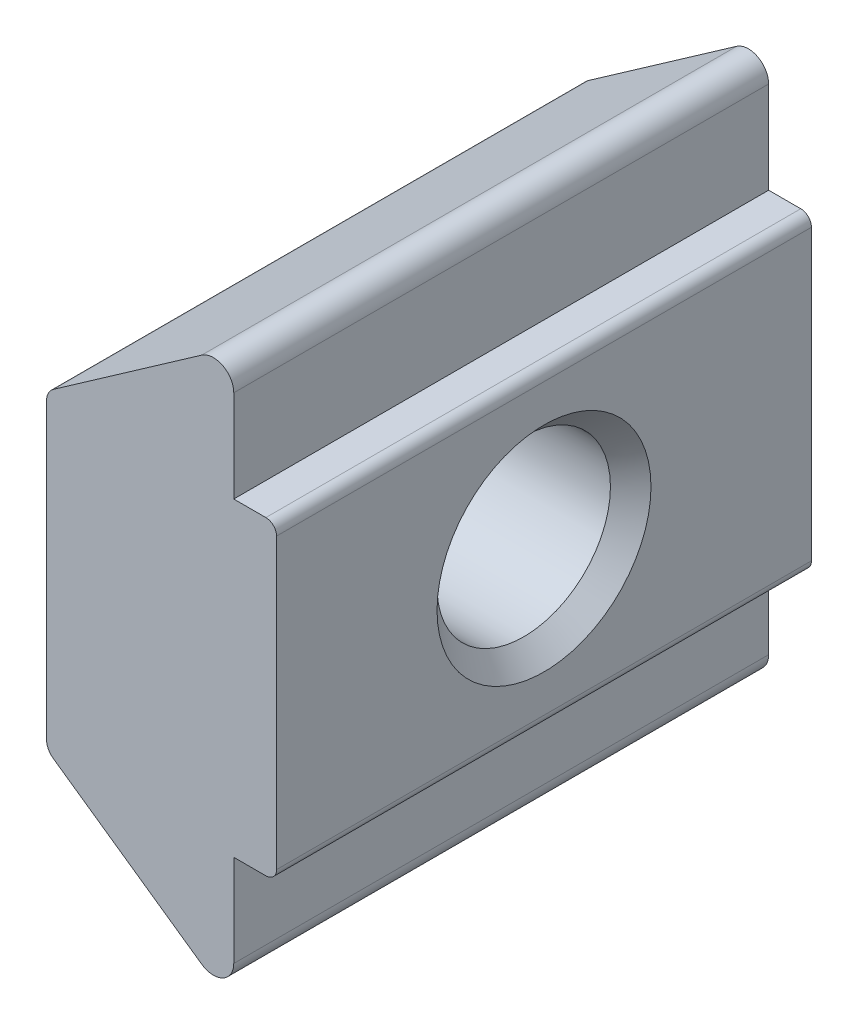
ISO-10303-21;
HEADER;
FILE_DESCRIPTION(('STEP AP214'),'2;1');
FILE_NAME('part.step','',(''),(''),'','','');
FILE_SCHEMA(('AUTOMOTIVE_DESIGN { 1 0 10303 214 1 1 1 1 }'));
ENDSEC;
DATA;
#1=APPLICATION_CONTEXT('core data for automotive mechanical design processes');
#2=APPLICATION_PROTOCOL_DEFINITION('international standard','automotive_design',2000,#1);
#3=PRODUCT_CONTEXT('',#1,'mechanical');
#4=PRODUCT('Part','Part','',(#3));
#5=PRODUCT_RELATED_PRODUCT_CATEGORY('part','',(#4));
#6=PRODUCT_DEFINITION_FORMATION('','',#4);
#7=PRODUCT_DEFINITION_CONTEXT('part definition',#1,'design');
#8=PRODUCT_DEFINITION('design','',#6,#7);
#9=PRODUCT_DEFINITION_SHAPE('','',#8);
#10=(LENGTH_UNIT() NAMED_UNIT(*) SI_UNIT(.MILLI.,.METRE.));
#11=(NAMED_UNIT(*) PLANE_ANGLE_UNIT() SI_UNIT($,.RADIAN.));
#12=(NAMED_UNIT(*) SI_UNIT($,.STERADIAN.) SOLID_ANGLE_UNIT());
#13=UNCERTAINTY_MEASURE_WITH_UNIT(LENGTH_MEASURE(1.E-05),#10,'distance_accuracy_value','');
#14=(GEOMETRIC_REPRESENTATION_CONTEXT(3) GLOBAL_UNCERTAINTY_ASSIGNED_CONTEXT((#13)) GLOBAL_UNIT_ASSIGNED_CONTEXT((#10,
#11,#12)) REPRESENTATION_CONTEXT('',''));
#15=CARTESIAN_POINT('',(0.,0.,0.));
#16=DIRECTION('',(0.,0.,1.));
#17=DIRECTION('',(1.,0.,0.));
#18=AXIS2_PLACEMENT_3D('',#15,#16,#17);
#19=CARTESIAN_POINT('',(-4.,2.74380333152799,5.));
#20=DIRECTION('',(0.,0.,-1.));
#21=DIRECTION('',(-1.,0.,0.));
#22=AXIS2_PLACEMENT_3D('',#19,#20,#21);
#23=CYLINDRICAL_SURFACE('',#22,0.3);
#24=CARTESIAN_POINT('',(-4.,2.74380333152799,-5.));
#25=DIRECTION('',(0.,0.,1.));
#26=DIRECTION('',(1.,0.,0.));
#27=AXIS2_PLACEMENT_3D('',#24,#25,#26);
#28=CIRCLE('',#27,0.3);
#29=CARTESIAN_POINT('',(-4.172038703309,2.98957290768371,-5.));
#30=VERTEX_POINT('',#29);
#31=CARTESIAN_POINT('',(-4.3,2.74380333152799,-5.));
#32=VERTEX_POINT('',#31);
#33=EDGE_CURVE('E11',#30,#32,#28,.T.);
#34=ORIENTED_EDGE('',*,*,#33,.T.);
#35=DIRECTION('',(0.,0.,-1.));
#36=VECTOR('',#35,1.);
#37=CARTESIAN_POINT('',(-4.3,2.74380333152799,5.));
#38=LINE('',#37,#36);
#39=CARTESIAN_POINT('',(-4.3,2.74380333152799,5.));
#40=VERTEX_POINT('',#39);
#41=EDGE_CURVE('E41',#40,#32,#38,.T.);
#42=ORIENTED_EDGE('',*,*,#41,.F.);
#43=CARTESIAN_POINT('',(-4.,2.74380333152799,5.));
#44=DIRECTION('',(0.,0.,1.));
#45=DIRECTION('',(1.,0.,0.));
#46=AXIS2_PLACEMENT_3D('',#43,#44,#45);
#47=CIRCLE('',#46,0.3);
#48=CARTESIAN_POINT('',(-4.172038703309,2.98957290768371,5.));
#49=VERTEX_POINT('',#48);
#50=EDGE_CURVE('E91',#49,#40,#47,.T.);
#51=ORIENTED_EDGE('',*,*,#50,.F.);
#52=DIRECTION('',(0.,0.,-1.));
#53=VECTOR('',#52,1.);
#54=CARTESIAN_POINT('',(-4.172038703309,2.98957290768371,5.));
#55=LINE('',#54,#53);
#56=EDGE_CURVE('E27',#49,#30,#55,.T.);
#57=ORIENTED_EDGE('',*,*,#56,.T.);
#58=EDGE_LOOP('',(#34,#42,#51,#57));
#59=FACE_BOUND('',#58,.T.);
#60=ADVANCED_FACE('F16',(#59),#23,.T.);
#61=CARTESIAN_POINT('',(-4.3,2.74380333152799,5.));
#62=DIRECTION('',(1.,0.,0.));
#63=DIRECTION('',(0.,1.,0.));
#64=AXIS2_PLACEMENT_3D('',#61,#62,#63);
#65=PLANE('',#64);
#66=CARTESIAN_POINT('',(-4.3,0.,0.));
#67=DIRECTION('',(1.,0.,0.));
#68=DIRECTION('',(0.,0.,-1.));
#69=AXIS2_PLACEMENT_3D('',#66,#67,#68);
#70=CIRCLE('',#69,2.);
#71=CARTESIAN_POINT('',(-4.3,0.,-2.));
#72=VERTEX_POINT('',#71);
#73=EDGE_CURVE('E293',#72,#72,#70,.T.);
#74=ORIENTED_EDGE('',*,*,#73,.T.);
#75=EDGE_LOOP('',(#74));
#76=FACE_BOUND('',#75,.T.);
#77=DIRECTION('',(0.,-1.,0.));
#78=VECTOR('',#77,1.);
#79=CARTESIAN_POINT('',(-4.3,2.74380333152799,-5.));
#80=LINE('',#79,#78);
#81=CARTESIAN_POINT('',(-4.3,-2.74380333152799,-5.));
#82=VERTEX_POINT('',#81);
#83=EDGE_CURVE('E188',#32,#82,#80,.T.);
#84=ORIENTED_EDGE('',*,*,#83,.T.);
#85=DIRECTION('',(0.,0.,-1.));
#86=VECTOR('',#85,1.);
#87=CARTESIAN_POINT('',(-4.3,-2.74380333152799,5.));
#88=LINE('',#87,#86);
#89=CARTESIAN_POINT('',(-4.3,-2.74380333152799,5.));
#90=VERTEX_POINT('',#89);
#91=EDGE_CURVE('E185',#90,#82,#88,.T.);
#92=ORIENTED_EDGE('',*,*,#91,.F.);
#93=DIRECTION('',(0.,-1.,0.));
#94=VECTOR('',#93,1.);
#95=CARTESIAN_POINT('',(-4.3,2.74380333152799,5.));
#96=LINE('',#95,#94);
#97=EDGE_CURVE('E176',#40,#90,#96,.T.);
#98=ORIENTED_EDGE('',*,*,#97,.F.);
#99=ORIENTED_EDGE('',*,*,#41,.T.);
#100=EDGE_LOOP('',(#84,#92,#98,#99));
#101=FACE_BOUND('',#100,.T.);
#102=ADVANCED_FACE('F186',(#76,#101),#65,.F.);
#103=CARTESIAN_POINT('',(-4.,-2.74380333152799,5.));
#104=DIRECTION('',(0.,0.,-1.));
#105=DIRECTION('',(-1.,0.,0.));
#106=AXIS2_PLACEMENT_3D('',#103,#104,#105);
#107=CYLINDRICAL_SURFACE('',#106,0.3);
#108=CARTESIAN_POINT('',(-4.,-2.74380333152799,-5.));
#109=DIRECTION('',(0.,0.,1.));
#110=DIRECTION('',(1.,0.,0.));
#111=AXIS2_PLACEMENT_3D('',#108,#109,#110);
#112=CIRCLE('',#111,0.3);
#113=CARTESIAN_POINT('',(-4.172038703309,-2.98957290768371,-5.));
#114=VERTEX_POINT('',#113);
#115=EDGE_CURVE('E193',#82,#114,#112,.T.);
#116=ORIENTED_EDGE('',*,*,#115,.T.);
#117=DIRECTION('',(0.,0.,-1.));
#118=VECTOR('',#117,1.);
#119=CARTESIAN_POINT('',(-4.172038703309,-2.98957290768371,5.));
#120=LINE('',#119,#118);
#121=CARTESIAN_POINT('',(-4.172038703309,-2.98957290768371,5.));
#122=VERTEX_POINT('',#121);
#123=EDGE_CURVE('E197',#122,#114,#120,.T.);
#124=ORIENTED_EDGE('',*,*,#123,.F.);
#125=CARTESIAN_POINT('',(-4.,-2.74380333152799,5.));
#126=DIRECTION('',(0.,0.,1.));
#127=DIRECTION('',(1.,0.,0.));
#128=AXIS2_PLACEMENT_3D('',#125,#126,#127);
#129=CIRCLE('',#128,0.3);
#130=EDGE_CURVE('E180',#90,#122,#129,.T.);
#131=ORIENTED_EDGE('',*,*,#130,.F.);
#132=ORIENTED_EDGE('',*,*,#91,.T.);
#133=EDGE_LOOP('',(#116,#124,#131,#132));
#134=FACE_BOUND('',#133,.T.);
#135=ADVANCED_FACE('F196',(#134),#107,.T.);
#136=CARTESIAN_POINT('',(-4.172038703309,-2.98957290768371,5.));
#137=DIRECTION('',(0.573462344363326,0.819231920519042,0.));
#138=DIRECTION('',(0.,0.,-1.));
#139=AXIS2_PLACEMENT_3D('',#136,#137,#138);
#140=PLANE('',#139);
#141=DIRECTION('',(0.819231920519042,-0.573462344363326,0.));
#142=VECTOR('',#141,1.);
#143=CARTESIAN_POINT('',(-4.172038703309,-2.98957290768371,-5.));
#144=LINE('',#143,#142);
#145=CARTESIAN_POINT('',(-1.39821476510065,-4.93124966442954,-5.));
#146=VERTEX_POINT('',#145);
#147=EDGE_CURVE('E194',#114,#146,#144,.T.);
#148=ORIENTED_EDGE('',*,*,#147,.T.);
#149=DIRECTION('',(0.,0.,-1.));
#150=VECTOR('',#149,1.);
#151=CARTESIAN_POINT('',(-1.39821476510065,-4.93124966442954,5.));
#152=LINE('',#151,#150);
#153=CARTESIAN_POINT('',(-1.39821476510065,-4.93124966442954,5.));
#154=VERTEX_POINT('',#153);
#155=EDGE_CURVE('E241',#154,#146,#152,.T.);
#156=ORIENTED_EDGE('',*,*,#155,.F.);
#157=DIRECTION('',(0.819231920519042,-0.573462344363326,0.));
#158=VECTOR('',#157,1.);
#159=CARTESIAN_POINT('',(-4.172038703309,-2.98957290768371,5.));
#160=LINE('',#159,#158);
#161=EDGE_CURVE('E200',#122,#154,#160,.T.);
#162=ORIENTED_EDGE('',*,*,#161,.F.);
#163=ORIENTED_EDGE('',*,*,#123,.T.);
#164=EDGE_LOOP('',(#148,#156,#162,#163));
#165=FACE_BOUND('',#164,.T.);
#166=ADVANCED_FACE('F361',(#165),#140,.F.);
#167=CARTESIAN_POINT('',(-1.18019999854669,-4.61976675709043,5.));
#168=DIRECTION('',(0.,0.,-1.));
#169=DIRECTION('',(-1.,0.,0.));
#170=AXIS2_PLACEMENT_3D('',#167,#168,#169);
#171=CYLINDRICAL_SURFACE('',#170,0.3802);
#172=CARTESIAN_POINT('',(-1.18019999854669,-4.61976675709043,-5.));
#173=DIRECTION('',(0.,0.,1.));
#174=DIRECTION('',(1.,0.,0.));
#175=AXIS2_PLACEMENT_3D('',#172,#173,#174);
#176=CIRCLE('',#175,0.3802);
#177=CARTESIAN_POINT('',(-0.8,-4.6198,-5.));
#178=VERTEX_POINT('',#177);
#179=EDGE_CURVE('E244',#146,#178,#176,.T.);
#180=ORIENTED_EDGE('',*,*,#179,.T.);
#181=DIRECTION('',(0.,0.,-1.));
#182=VECTOR('',#181,1.);
#183=CARTESIAN_POINT('',(-0.8,-4.6198,5.));
#184=LINE('',#183,#182);
#185=CARTESIAN_POINT('',(-0.8,-4.6198,5.));
#186=VERTEX_POINT('',#185);
#187=EDGE_CURVE('E166',#186,#178,#184,.T.);
#188=ORIENTED_EDGE('',*,*,#187,.F.);
#189=CARTESIAN_POINT('',(-1.18019999854669,-4.61976675709043,5.));
#190=DIRECTION('',(0.,0.,1.));
#191=DIRECTION('',(1.,0.,0.));
#192=AXIS2_PLACEMENT_3D('',#189,#190,#191);
#193=CIRCLE('',#192,0.3802);
#194=EDGE_CURVE('E155',#154,#186,#193,.T.);
#195=ORIENTED_EDGE('',*,*,#194,.F.);
#196=ORIENTED_EDGE('',*,*,#155,.T.);
#197=EDGE_LOOP('',(#180,#188,#195,#196));
#198=FACE_BOUND('',#197,.T.);
#199=ADVANCED_FACE('F386',(#198),#171,.T.);
#200=CARTESIAN_POINT('',(-0.8,-4.6198,5.));
#201=DIRECTION('',(-1.,0.,0.));
#202=DIRECTION('',(0.,0.,1.));
#203=AXIS2_PLACEMENT_3D('',#200,#201,#202);
#204=PLANE('',#203);
#205=DIRECTION('',(0.,1.,0.));
#206=VECTOR('',#205,1.);
#207=CARTESIAN_POINT('',(-0.8,-4.6198,-5.));
#208=LINE('',#207,#206);
#209=CARTESIAN_POINT('',(-0.8,-2.9,-5.));
#210=VERTEX_POINT('',#209);
#211=EDGE_CURVE('E215',#178,#210,#208,.T.);
#212=ORIENTED_EDGE('',*,*,#211,.T.);
#213=DIRECTION('',(0.,0.,-1.));
#214=VECTOR('',#213,1.);
#215=CARTESIAN_POINT('',(-0.8,-2.9,5.));
#216=LINE('',#215,#214);
#217=CARTESIAN_POINT('',(-0.8,-2.9,5.));
#218=VERTEX_POINT('',#217);
#219=EDGE_CURVE('E208',#218,#210,#216,.T.);
#220=ORIENTED_EDGE('',*,*,#219,.F.);
#221=DIRECTION('',(0.,1.,0.));
#222=VECTOR('',#221,1.);
#223=CARTESIAN_POINT('',(-0.8,-4.6198,5.));
#224=LINE('',#223,#222);
#225=EDGE_CURVE('E239',#186,#218,#224,.T.);
#226=ORIENTED_EDGE('',*,*,#225,.F.);
#227=ORIENTED_EDGE('',*,*,#187,.T.);
#228=EDGE_LOOP('',(#212,#220,#226,#227));
#229=FACE_BOUND('',#228,.T.);
#230=ADVANCED_FACE('F367',(#229),#204,.F.);
#231=CARTESIAN_POINT('',(-0.8,-2.9,5.));
#232=DIRECTION('',(0.,1.,0.));
#233=DIRECTION('',(1.,0.,0.));
#234=AXIS2_PLACEMENT_3D('',#231,#232,#233);
#235=PLANE('',#234);
#236=DIRECTION('',(1.,0.,0.));
#237=VECTOR('',#236,1.);
#238=CARTESIAN_POINT('',(-0.8,-2.9,-5.));
#239=LINE('',#238,#237);
#240=CARTESIAN_POINT('',(-0.200000000000006,-2.9,-5.));
#241=VERTEX_POINT('',#240);
#242=EDGE_CURVE('E211',#210,#241,#239,.T.);
#243=ORIENTED_EDGE('',*,*,#242,.T.);
#244=DIRECTION('',(0.,0.,-1.));
#245=VECTOR('',#244,1.);
#246=CARTESIAN_POINT('',(-0.200000000000006,-2.9,5.));
#247=LINE('',#246,#245);
#248=CARTESIAN_POINT('',(-0.200000000000006,-2.9,5.));
#249=VERTEX_POINT('',#248);
#250=EDGE_CURVE('E234',#249,#241,#247,.T.);
#251=ORIENTED_EDGE('',*,*,#250,.F.);
#252=DIRECTION('',(1.,0.,0.));
#253=VECTOR('',#252,1.);
#254=CARTESIAN_POINT('',(-0.8,-2.9,5.));
#255=LINE('',#254,#253);
#256=EDGE_CURVE('E236',#218,#249,#255,.T.);
#257=ORIENTED_EDGE('',*,*,#256,.F.);
#258=ORIENTED_EDGE('',*,*,#219,.T.);
#259=EDGE_LOOP('',(#243,#251,#257,#258));
#260=FACE_BOUND('',#259,.T.);
#261=ADVANCED_FACE('F363',(#260),#235,.F.);
#262=CARTESIAN_POINT('',(-0.2,-2.7,5.));
#263=DIRECTION('',(0.,0.,-1.));
#264=DIRECTION('',(-1.,0.,0.));
#265=AXIS2_PLACEMENT_3D('',#262,#263,#264);
#266=CYLINDRICAL_SURFACE('',#265,0.2);
#267=CARTESIAN_POINT('',(-0.2,-2.7,-5.));
#268=DIRECTION('',(0.,0.,1.));
#269=DIRECTION('',(1.,0.,0.));
#270=AXIS2_PLACEMENT_3D('',#267,#268,#269);
#271=CIRCLE('',#270,0.2);
#272=CARTESIAN_POINT('',(0.,-2.7,-5.));
#273=VERTEX_POINT('',#272);
#274=EDGE_CURVE('E212',#241,#273,#271,.T.);
#275=ORIENTED_EDGE('',*,*,#274,.T.);
#276=DIRECTION('',(0.,0.,-1.));
#277=VECTOR('',#276,1.);
#278=CARTESIAN_POINT('',(0.,-2.7,5.));
#279=LINE('',#278,#277);
#280=CARTESIAN_POINT('',(0.,-2.7,5.));
#281=VERTEX_POINT('',#280);
#282=EDGE_CURVE('E235',#281,#273,#279,.T.);
#283=ORIENTED_EDGE('',*,*,#282,.F.);
#284=CARTESIAN_POINT('',(-0.2,-2.7,5.));
#285=DIRECTION('',(0.,0.,1.));
#286=DIRECTION('',(1.,0.,0.));
#287=AXIS2_PLACEMENT_3D('',#284,#285,#286);
#288=CIRCLE('',#287,0.2);
#289=EDGE_CURVE('E240',#249,#281,#288,.T.);
#290=ORIENTED_EDGE('',*,*,#289,.F.);
#291=ORIENTED_EDGE('',*,*,#250,.T.);
#292=EDGE_LOOP('',(#275,#283,#290,#291));
#293=FACE_BOUND('',#292,.T.);
#294=ADVANCED_FACE('F366',(#293),#266,.T.);
#295=CARTESIAN_POINT('',(0.,-2.7,5.));
#296=DIRECTION('',(-1.,0.,0.));
#297=DIRECTION('',(0.,0.,1.));
#298=AXIS2_PLACEMENT_3D('',#295,#296,#297);
#299=PLANE('',#298);
#300=CARTESIAN_POINT('',(0.,0.,0.));
#301=DIRECTION('',(1.,0.,0.));
#302=DIRECTION('',(0.,0.,-1.));
#303=AXIS2_PLACEMENT_3D('',#300,#301,#302);
#304=CIRCLE('',#303,2.);
#305=CARTESIAN_POINT('',(0.,0.,-2.));
#306=VERTEX_POINT('',#305);
#307=EDGE_CURVE('E20',#306,#306,#304,.T.);
#308=ORIENTED_EDGE('',*,*,#307,.F.);
#309=EDGE_LOOP('',(#308));
#310=FACE_BOUND('',#309,.T.);
#311=DIRECTION('',(0.,1.,0.));
#312=VECTOR('',#311,1.);
#313=CARTESIAN_POINT('',(0.,-2.7,-5.));
#314=LINE('',#313,#312);
#315=CARTESIAN_POINT('',(0.,2.7,-5.));
#316=VERTEX_POINT('',#315);
#317=EDGE_CURVE('E230',#273,#316,#314,.T.);
#318=ORIENTED_EDGE('',*,*,#317,.T.);
#319=DIRECTION('',(0.,0.,-1.));
#320=VECTOR('',#319,1.);
#321=CARTESIAN_POINT('',(0.,2.7,5.));
#322=LINE('',#321,#320);
#323=CARTESIAN_POINT('',(0.,2.7,5.));
#324=VERTEX_POINT('',#323);
#325=EDGE_CURVE('E247',#324,#316,#322,.T.);
#326=ORIENTED_EDGE('',*,*,#325,.F.);
#327=DIRECTION('',(0.,1.,0.));
#328=VECTOR('',#327,1.);
#329=CARTESIAN_POINT('',(0.,-2.7,5.));
#330=LINE('',#329,#328);
#331=EDGE_CURVE('E249',#281,#324,#330,.T.);
#332=ORIENTED_EDGE('',*,*,#331,.F.);
#333=ORIENTED_EDGE('',*,*,#282,.T.);
#334=EDGE_LOOP('',(#318,#326,#332,#333));
#335=FACE_BOUND('',#334,.T.);
#336=ADVANCED_FACE('F369',(#310,#335),#299,.F.);
#337=CARTESIAN_POINT('',(-0.2,2.7,5.));
#338=DIRECTION('',(0.,0.,-1.));
#339=DIRECTION('',(-1.,0.,0.));
#340=AXIS2_PLACEMENT_3D('',#337,#338,#339);
#341=CYLINDRICAL_SURFACE('',#340,0.2);
#342=CARTESIAN_POINT('',(-0.2,2.7,-5.));
#343=DIRECTION('',(0.,0.,1.));
#344=DIRECTION('',(1.,0.,0.));
#345=AXIS2_PLACEMENT_3D('',#342,#343,#344);
#346=CIRCLE('',#345,0.2);
#347=CARTESIAN_POINT('',(-0.2,2.9,-5.));
#348=VERTEX_POINT('',#347);
#349=EDGE_CURVE('E259',#316,#348,#346,.T.);
#350=ORIENTED_EDGE('',*,*,#349,.T.);
#351=DIRECTION('',(0.,0.,-1.));
#352=VECTOR('',#351,1.);
#353=CARTESIAN_POINT('',(-0.2,2.9,5.));
#354=LINE('',#353,#352);
#355=CARTESIAN_POINT('',(-0.2,2.9,5.));
#356=VERTEX_POINT('',#355);
#357=EDGE_CURVE('E216',#356,#348,#354,.T.);
#358=ORIENTED_EDGE('',*,*,#357,.F.);
#359=CARTESIAN_POINT('',(-0.2,2.7,5.));
#360=DIRECTION('',(0.,0.,1.));
#361=DIRECTION('',(1.,0.,0.));
#362=AXIS2_PLACEMENT_3D('',#359,#360,#361);
#363=CIRCLE('',#362,0.2);
#364=EDGE_CURVE('E224',#324,#356,#363,.T.);
#365=ORIENTED_EDGE('',*,*,#364,.F.);
#366=ORIENTED_EDGE('',*,*,#325,.T.);
#367=EDGE_LOOP('',(#350,#358,#365,#366));
#368=FACE_BOUND('',#367,.T.);
#369=ADVANCED_FACE('F18',(#368),#341,.T.);
#370=CARTESIAN_POINT('',(-0.2,2.9,5.));
#371=DIRECTION('',(0.,-1.,0.));
#372=DIRECTION('',(0.,0.,-1.));
#373=AXIS2_PLACEMENT_3D('',#370,#371,#372);
#374=PLANE('',#373);
#375=DIRECTION('',(-1.,0.,0.));
#376=VECTOR('',#375,1.);
#377=CARTESIAN_POINT('',(-0.2,2.9,-5.));
#378=LINE('',#377,#376);
#379=CARTESIAN_POINT('',(-0.8,2.9,-5.));
#380=VERTEX_POINT('',#379);
#381=EDGE_CURVE('E219',#348,#380,#378,.T.);
#382=ORIENTED_EDGE('',*,*,#381,.T.);
#383=DIRECTION('',(0.,0.,-1.));
#384=VECTOR('',#383,1.);
#385=CARTESIAN_POINT('',(-0.8,2.9,5.));
#386=LINE('',#385,#384);
#387=CARTESIAN_POINT('',(-0.8,2.9,5.));
#388=VERTEX_POINT('',#387);
#389=EDGE_CURVE('E274',#388,#380,#386,.T.);
#390=ORIENTED_EDGE('',*,*,#389,.F.);
#391=DIRECTION('',(-1.,0.,0.));
#392=VECTOR('',#391,1.);
#393=CARTESIAN_POINT('',(-0.2,2.9,5.));
#394=LINE('',#393,#392);
#395=EDGE_CURVE('E221',#356,#388,#394,.T.);
#396=ORIENTED_EDGE('',*,*,#395,.F.);
#397=ORIENTED_EDGE('',*,*,#357,.T.);
#398=EDGE_LOOP('',(#382,#390,#396,#397));
#399=FACE_BOUND('',#398,.T.);
#400=ADVANCED_FACE('F376',(#399),#374,.F.);
#401=CARTESIAN_POINT('',(-0.8,2.9,5.));
#402=DIRECTION('',(-1.,0.,0.));
#403=DIRECTION('',(0.,0.,1.));
#404=AXIS2_PLACEMENT_3D('',#401,#402,#403);
#405=PLANE('',#404);
#406=DIRECTION('',(0.,1.,0.));
#407=VECTOR('',#406,1.);
#408=CARTESIAN_POINT('',(-0.8,2.9,-5.));
#409=LINE('',#408,#407);
#410=CARTESIAN_POINT('',(-0.8,4.6198,-5.));
#411=VERTEX_POINT('',#410);
#412=EDGE_CURVE('E220',#380,#411,#409,.T.);
#413=ORIENTED_EDGE('',*,*,#412,.T.);
#414=DIRECTION('',(0.,0.,-1.));
#415=VECTOR('',#414,1.);
#416=CARTESIAN_POINT('',(-0.8,4.6198,5.));
#417=LINE('',#416,#415);
#418=CARTESIAN_POINT('',(-0.8,4.6198,5.));
#419=VERTEX_POINT('',#418);
#420=EDGE_CURVE('E252',#419,#411,#417,.T.);
#421=ORIENTED_EDGE('',*,*,#420,.F.);
#422=DIRECTION('',(0.,1.,0.));
#423=VECTOR('',#422,1.);
#424=CARTESIAN_POINT('',(-0.8,2.9,5.));
#425=LINE('',#424,#423);
#426=EDGE_CURVE('E225',#388,#419,#425,.T.);
#427=ORIENTED_EDGE('',*,*,#426,.F.);
#428=ORIENTED_EDGE('',*,*,#389,.T.);
#429=EDGE_LOOP('',(#413,#421,#427,#428));
#430=FACE_BOUND('',#429,.T.);
#431=ADVANCED_FACE('F379',(#430),#405,.F.);
#432=CARTESIAN_POINT('',(-1.1801999985467,4.61976675709044,5.));
#433=DIRECTION('',(0.,0.,-1.));
#434=DIRECTION('',(-1.,0.,0.));
#435=AXIS2_PLACEMENT_3D('',#432,#433,#434);
#436=CYLINDRICAL_SURFACE('',#435,0.3802);
#437=CARTESIAN_POINT('',(-1.1801999985467,4.61976675709044,-5.));
#438=DIRECTION('',(0.,0.,1.));
#439=DIRECTION('',(1.,0.,0.));
#440=AXIS2_PLACEMENT_3D('',#437,#438,#439);
#441=CIRCLE('',#440,0.3802);
#442=CARTESIAN_POINT('',(-1.39821476510067,4.93124966442954,-5.));
#443=VERTEX_POINT('',#442);
#444=EDGE_CURVE('E255',#411,#443,#441,.T.);
#445=ORIENTED_EDGE('',*,*,#444,.T.);
#446=DIRECTION('',(0.,0.,-1.));
#447=VECTOR('',#446,1.);
#448=CARTESIAN_POINT('',(-1.39821476510067,4.93124966442954,5.));
#449=LINE('',#448,#447);
#450=CARTESIAN_POINT('',(-1.39821476510067,4.93124966442954,5.));
#451=VERTEX_POINT('',#450);
#452=EDGE_CURVE('E266',#451,#443,#449,.T.);
#453=ORIENTED_EDGE('',*,*,#452,.F.);
#454=CARTESIAN_POINT('',(-1.1801999985467,4.61976675709044,5.));
#455=DIRECTION('',(0.,0.,1.));
#456=DIRECTION('',(1.,0.,0.));
#457=AXIS2_PLACEMENT_3D('',#454,#455,#456);
#458=CIRCLE('',#457,0.3802);
#459=EDGE_CURVE('E280',#419,#451,#458,.T.);
#460=ORIENTED_EDGE('',*,*,#459,.F.);
#461=ORIENTED_EDGE('',*,*,#420,.T.);
#462=EDGE_LOOP('',(#445,#453,#460,#461));
#463=FACE_BOUND('',#462,.T.);
#464=ADVANCED_FACE('F390',(#463),#436,.T.);
#465=CARTESIAN_POINT('',(-1.39821476510067,4.93124966442954,5.));
#466=DIRECTION('',(0.573462344363329,-0.81923192051904,0.));
#467=DIRECTION('',(0.,0.,-1.));
#468=AXIS2_PLACEMENT_3D('',#465,#466,#467);
#469=PLANE('',#468);
#470=DIRECTION('',(-0.81923192051904,-0.573462344363329,0.));
#471=VECTOR('',#470,1.);
#472=CARTESIAN_POINT('',(-1.39821476510067,4.93124966442954,-5.));
#473=LINE('',#472,#471);
#474=EDGE_CURVE('E256',#443,#30,#473,.T.);
#475=ORIENTED_EDGE('',*,*,#474,.T.);
#476=ORIENTED_EDGE('',*,*,#56,.F.);
#477=DIRECTION('',(-0.81923192051904,-0.573462344363329,0.));
#478=VECTOR('',#477,1.);
#479=CARTESIAN_POINT('',(-1.39821476510067,4.93124966442954,5.));
#480=LINE('',#479,#478);
#481=EDGE_CURVE('E277',#451,#49,#480,.T.);
#482=ORIENTED_EDGE('',*,*,#481,.F.);
#483=ORIENTED_EDGE('',*,*,#452,.T.);
#484=EDGE_LOOP('',(#475,#476,#482,#483));
#485=FACE_BOUND('',#484,.T.);
#486=ADVANCED_FACE('F375',(#485),#469,.F.);
#487=CARTESIAN_POINT('',(-4.,2.74380333152799,5.));
#488=DIRECTION('',(0.,0.,1.));
#489=DIRECTION('',(1.,0.,0.));
#490=AXIS2_PLACEMENT_3D('',#487,#488,#489);
#491=PLANE('',#490);
#492=ORIENTED_EDGE('',*,*,#50,.T.);
#493=ORIENTED_EDGE('',*,*,#97,.T.);
#494=ORIENTED_EDGE('',*,*,#130,.T.);
#495=ORIENTED_EDGE('',*,*,#161,.T.);
#496=ORIENTED_EDGE('',*,*,#194,.T.);
#497=ORIENTED_EDGE('',*,*,#225,.T.);
#498=ORIENTED_EDGE('',*,*,#256,.T.);
#499=ORIENTED_EDGE('',*,*,#289,.T.);
#500=ORIENTED_EDGE('',*,*,#331,.T.);
#501=ORIENTED_EDGE('',*,*,#364,.T.);
#502=ORIENTED_EDGE('',*,*,#395,.T.);
#503=ORIENTED_EDGE('',*,*,#426,.T.);
#504=ORIENTED_EDGE('',*,*,#459,.T.);
#505=ORIENTED_EDGE('',*,*,#481,.T.);
#506=EDGE_LOOP('',(#492,#493,#494,#495,#496,#497,#498,#499,#500,#501,#502,#503,#504,#505));
#507=FACE_BOUND('',#506,.T.);
#508=ADVANCED_FACE('F178',(#507),#491,.T.);
#509=CARTESIAN_POINT('',(-4.,2.74380333152799,-5.));
#510=DIRECTION('',(0.,0.,1.));
#511=DIRECTION('',(1.,0.,0.));
#512=AXIS2_PLACEMENT_3D('',#509,#510,#511);
#513=PLANE('',#512);
#514=ORIENTED_EDGE('',*,*,#33,.F.);
#515=ORIENTED_EDGE('',*,*,#474,.F.);
#516=ORIENTED_EDGE('',*,*,#444,.F.);
#517=ORIENTED_EDGE('',*,*,#412,.F.);
#518=ORIENTED_EDGE('',*,*,#381,.F.);
#519=ORIENTED_EDGE('',*,*,#349,.F.);
#520=ORIENTED_EDGE('',*,*,#317,.F.);
#521=ORIENTED_EDGE('',*,*,#274,.F.);
#522=ORIENTED_EDGE('',*,*,#242,.F.);
#523=ORIENTED_EDGE('',*,*,#211,.F.);
#524=ORIENTED_EDGE('',*,*,#179,.F.);
#525=ORIENTED_EDGE('',*,*,#147,.F.);
#526=ORIENTED_EDGE('',*,*,#115,.F.);
#527=ORIENTED_EDGE('',*,*,#83,.F.);
#528=EDGE_LOOP('',(#514,#515,#516,#517,#518,#519,#520,#521,#522,#523,#524,#525,#526,#527));
#529=FACE_BOUND('',#528,.T.);
#530=ADVANCED_FACE('F349',(#529),#513,.F.);
#531=CARTESIAN_POINT('',(-4.3,0.,0.));
#532=DIRECTION('',(-1.,0.,0.));
#533=DIRECTION('',(0.,0.,1.));
#534=AXIS2_PLACEMENT_3D('',#531,#532,#533);
#535=CONICAL_SURFACE('',#534,2.,0.785398163397448);
#536=CARTESIAN_POINT('',(-3.921,0.,0.));
#537=DIRECTION('',(1.,0.,0.));
#538=DIRECTION('',(0.,0.,-1.));
#539=AXIS2_PLACEMENT_3D('',#536,#537,#538);
#540=CIRCLE('',#539,1.621);
#541=CARTESIAN_POINT('',(-3.921,0.,-1.621));
#542=VERTEX_POINT('',#541);
#543=EDGE_CURVE('E281',#542,#542,#540,.T.);
#544=ORIENTED_EDGE('',*,*,#543,.T.);
#545=EDGE_LOOP('',(#544));
#546=FACE_BOUND('',#545,.T.);
#547=ORIENTED_EDGE('',*,*,#73,.F.);
#548=EDGE_LOOP('',(#547));
#549=FACE_BOUND('',#548,.T.);
#550=ADVANCED_FACE('F335',(#546,#549),#535,.F.);
#551=CARTESIAN_POINT('',(0.,0.,0.));
#552=DIRECTION('',(1.,0.,0.));
#553=DIRECTION('',(0.,0.,-1.));
#554=AXIS2_PLACEMENT_3D('',#551,#552,#553);
#555=CYLINDRICAL_SURFACE('',#554,1.621);
#556=CARTESIAN_POINT('',(-0.379,0.,0.));
#557=DIRECTION('',(1.,0.,0.));
#558=DIRECTION('',(0.,0.,-1.));
#559=AXIS2_PLACEMENT_3D('',#556,#557,#558);
#560=CIRCLE('',#559,1.621);
#561=CARTESIAN_POINT('',(-0.379,0.,-1.621));
#562=VERTEX_POINT('',#561);
#563=EDGE_CURVE('E282',#562,#562,#560,.T.);
#564=ORIENTED_EDGE('',*,*,#563,.T.);
#565=EDGE_LOOP('',(#564));
#566=FACE_BOUND('',#565,.T.);
#567=ORIENTED_EDGE('',*,*,#543,.F.);
#568=EDGE_LOOP('',(#567));
#569=FACE_BOUND('',#568,.T.);
#570=ADVANCED_FACE('F338',(#566,#569),#555,.F.);
#571=CARTESIAN_POINT('',(-0.379,0.,0.));
#572=DIRECTION('',(1.,0.,0.));
#573=DIRECTION('',(0.,0.,-1.));
#574=AXIS2_PLACEMENT_3D('',#571,#572,#573);
#575=CONICAL_SURFACE('',#574,1.621,0.785398163397448);
#576=ORIENTED_EDGE('',*,*,#307,.T.);
#577=EDGE_LOOP('',(#576));
#578=FACE_BOUND('',#577,.T.);
#579=ORIENTED_EDGE('',*,*,#563,.F.);
#580=EDGE_LOOP('',(#579));
#581=FACE_BOUND('',#580,.T.);
#582=ADVANCED_FACE('F340',(#578,#581),#575,.F.);
#583=CLOSED_SHELL('',(#60,#102,#135,#166,#199,#230,#261,#294,#336,#369,#400,#431,#464,#486,#508,
#530,#550,#570,#582));
#584=MANIFOLD_SOLID_BREP('B1',#583);
#585=ADVANCED_BREP_SHAPE_REPRESENTATION('',(#18,#584),#14);
#586=SHAPE_DEFINITION_REPRESENTATION(#9,#585);
ENDSEC;
END-ISO-10303-21;
